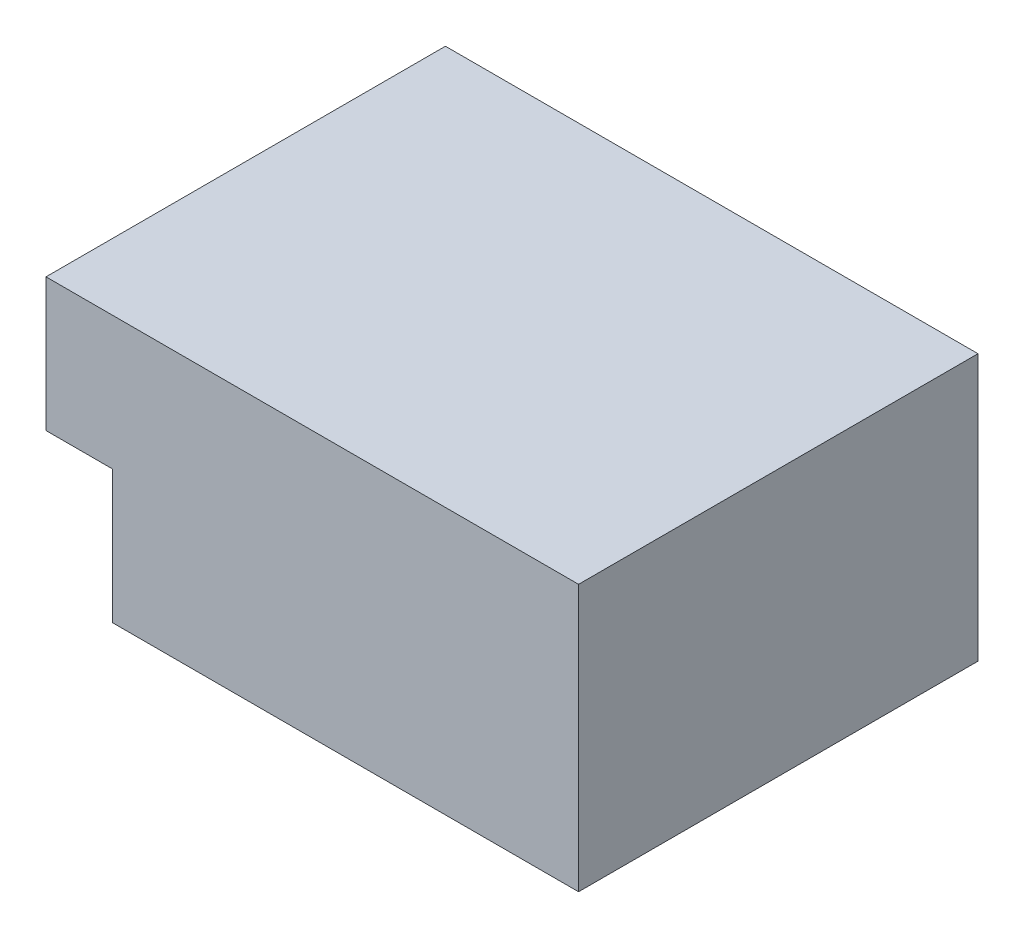
ISO-10303-21;
HEADER;
FILE_DESCRIPTION(('STEP AP214'),'2;1');
FILE_NAME('part.step','',(''),(''),'','','');
FILE_SCHEMA(('AUTOMOTIVE_DESIGN { 1 0 10303 214 1 1 1 1 }'));
ENDSEC;
DATA;
#1=APPLICATION_CONTEXT('core data for automotive mechanical design processes');
#2=APPLICATION_PROTOCOL_DEFINITION('international standard','automotive_design',2000,#1);
#3=PRODUCT_CONTEXT('',#1,'mechanical');
#4=PRODUCT('Part','Part','',(#3));
#5=PRODUCT_RELATED_PRODUCT_CATEGORY('part','',(#4));
#6=PRODUCT_DEFINITION_FORMATION('','',#4);
#7=PRODUCT_DEFINITION_CONTEXT('part definition',#1,'design');
#8=PRODUCT_DEFINITION('design','',#6,#7);
#9=PRODUCT_DEFINITION_SHAPE('','',#8);
#10=(LENGTH_UNIT() NAMED_UNIT(*) SI_UNIT(.MILLI.,.METRE.));
#11=(NAMED_UNIT(*) PLANE_ANGLE_UNIT() SI_UNIT($,.RADIAN.));
#12=(NAMED_UNIT(*) SI_UNIT($,.STERADIAN.) SOLID_ANGLE_UNIT());
#13=UNCERTAINTY_MEASURE_WITH_UNIT(LENGTH_MEASURE(1.E-05),#10,'distance_accuracy_value','');
#14=(GEOMETRIC_REPRESENTATION_CONTEXT(3) GLOBAL_UNCERTAINTY_ASSIGNED_CONTEXT((#13)) GLOBAL_UNIT_ASSIGNED_CONTEXT((#10,
#11,#12)) REPRESENTATION_CONTEXT('',''));
#15=CARTESIAN_POINT('',(0.,0.,0.));
#16=DIRECTION('',(0.,0.,1.));
#17=DIRECTION('',(1.,0.,0.));
#18=AXIS2_PLACEMENT_3D('',#15,#16,#17);
#19=CARTESIAN_POINT('',(0.,0.,0.));
#20=DIRECTION('',(0.,-1.,0.));
#21=DIRECTION('',(-1.,0.,0.));
#22=AXIS2_PLACEMENT_3D('',#19,#20,#21);
#23=PLANE('',#22);
#24=DIRECTION('',(0.,0.,-1.));
#25=VECTOR('',#24,1.);
#26=CARTESIAN_POINT('',(-1.95,0.,1.35));
#27=LINE('',#26,#25);
#28=CARTESIAN_POINT('',(-1.95,0.,1.35));
#29=VERTEX_POINT('',#28);
#30=CARTESIAN_POINT('',(-1.95,0.,1.05));
#31=VERTEX_POINT('',#30);
#32=EDGE_CURVE('E11',#29,#31,#27,.T.);
#33=ORIENTED_EDGE('',*,*,#32,.T.);
#34=DIRECTION('',(1.,0.,0.));
#35=VECTOR('',#34,1.);
#36=CARTESIAN_POINT('',(-1.95,0.,1.05));
#37=LINE('',#36,#35);
#38=CARTESIAN_POINT('',(-1.6,0.,1.05));
#39=VERTEX_POINT('',#38);
#40=EDGE_CURVE('E115',#31,#39,#37,.T.);
#41=ORIENTED_EDGE('',*,*,#40,.T.);
#42=DIRECTION('',(0.,0.,-1.));
#43=VECTOR('',#42,1.);
#44=CARTESIAN_POINT('',(-1.6,0.,1.35));
#45=LINE('',#44,#43);
#46=CARTESIAN_POINT('',(-1.6,0.,1.35));
#47=VERTEX_POINT('',#46);
#48=EDGE_CURVE('E109',#47,#39,#45,.T.);
#49=ORIENTED_EDGE('',*,*,#48,.F.);
#50=DIRECTION('',(-1.,0.,0.));
#51=VECTOR('',#50,1.);
#52=CARTESIAN_POINT('',(-1.6,0.,1.35));
#53=LINE('',#52,#51);
#54=EDGE_CURVE('E101',#47,#29,#53,.T.);
#55=ORIENTED_EDGE('',*,*,#54,.T.);
#56=EDGE_LOOP('',(#33,#41,#49,#55));
#57=FACE_BOUND('',#56,.T.);
#58=ADVANCED_FACE('F17',(#57),#23,.T.);
#59=CARTESIAN_POINT('',(-1.75,0.,1.35));
#60=DIRECTION('',(0.,0.,-1.));
#61=DIRECTION('',(-1.,0.,0.));
#62=AXIS2_PLACEMENT_3D('',#59,#60,#61);
#63=PLANE('',#62);
#64=DIRECTION('',(0.,1.,0.));
#65=VECTOR('',#64,1.);
#66=CARTESIAN_POINT('',(-2.,0.1,1.35));
#67=LINE('',#66,#65);
#68=CARTESIAN_POINT('',(-2.,0.1,1.35));
#69=VERTEX_POINT('',#68);
#70=CARTESIAN_POINT('',(-2.,0.2,1.35));
#71=VERTEX_POINT('',#70);
#72=EDGE_CURVE('E24',#69,#71,#67,.T.);
#73=ORIENTED_EDGE('',*,*,#72,.F.);
#74=DIRECTION('',(1.,0.,0.));
#75=VECTOR('',#74,1.);
#76=CARTESIAN_POINT('',(-2.,0.1,1.35));
#77=LINE('',#76,#75);
#78=CARTESIAN_POINT('',(-1.95,0.1,1.35));
#79=VERTEX_POINT('',#78);
#80=EDGE_CURVE('E85',#69,#79,#77,.T.);
#81=ORIENTED_EDGE('',*,*,#80,.T.);
#82=DIRECTION('',(0.,1.,0.));
#83=VECTOR('',#82,1.);
#84=CARTESIAN_POINT('',(-1.95,0.,1.35));
#85=LINE('',#84,#83);
#86=EDGE_CURVE('E103',#29,#79,#85,.T.);
#87=ORIENTED_EDGE('',*,*,#86,.F.);
#88=ORIENTED_EDGE('',*,*,#54,.F.);
#89=DIRECTION('',(0.,1.,0.));
#90=VECTOR('',#89,1.);
#91=CARTESIAN_POINT('',(-1.6,0.,1.35));
#92=LINE('',#91,#90);
#93=CARTESIAN_POINT('',(-1.6,0.2,1.35));
#94=VERTEX_POINT('',#93);
#95=EDGE_CURVE('E80',#47,#94,#92,.T.);
#96=ORIENTED_EDGE('',*,*,#95,.T.);
#97=DIRECTION('',(-1.,0.,0.));
#98=VECTOR('',#97,1.);
#99=CARTESIAN_POINT('',(-1.6,0.2,1.35));
#100=LINE('',#99,#98);
#101=EDGE_CURVE('E79',#94,#71,#100,.T.);
#102=ORIENTED_EDGE('',*,*,#101,.T.);
#103=EDGE_LOOP('',(#73,#81,#87,#88,#96,#102));
#104=FACE_BOUND('',#103,.T.);
#105=ADVANCED_FACE('F117',(#104),#63,.F.);
#106=CARTESIAN_POINT('',(0.,0.2,0.));
#107=DIRECTION('',(0.,-1.,0.));
#108=DIRECTION('',(-1.,0.,0.));
#109=AXIS2_PLACEMENT_3D('',#106,#107,#108);
#110=PLANE('',#109);
#111=DIRECTION('',(1.,0.,0.));
#112=VECTOR('',#111,1.);
#113=CARTESIAN_POINT('',(-2.,0.2,1.05));
#114=LINE('',#113,#112);
#115=CARTESIAN_POINT('',(-2.,0.2,1.05));
#116=VERTEX_POINT('',#115);
#117=CARTESIAN_POINT('',(-1.6,0.2,1.05));
#118=VERTEX_POINT('',#117);
#119=EDGE_CURVE('E113',#116,#118,#114,.T.);
#120=ORIENTED_EDGE('',*,*,#119,.F.);
#121=DIRECTION('',(0.,0.,-1.));
#122=VECTOR('',#121,1.);
#123=CARTESIAN_POINT('',(-2.,0.2,1.35));
#124=LINE('',#123,#122);
#125=EDGE_CURVE('E91',#71,#116,#124,.T.);
#126=ORIENTED_EDGE('',*,*,#125,.F.);
#127=ORIENTED_EDGE('',*,*,#101,.F.);
#128=DIRECTION('',(0.,0.,1.));
#129=VECTOR('',#128,1.);
#130=CARTESIAN_POINT('',(-1.6,0.2,1.05));
#131=LINE('',#130,#129);
#132=EDGE_CURVE('E98',#118,#94,#131,.T.);
#133=ORIENTED_EDGE('',*,*,#132,.F.);
#134=EDGE_LOOP('',(#120,#126,#127,#133));
#135=FACE_BOUND('',#134,.T.);
#136=ADVANCED_FACE('F122',(#135),#110,.F.);
#137=CARTESIAN_POINT('',(-1.6,0.,1.35));
#138=DIRECTION('',(1.,0.,0.));
#139=DIRECTION('',(0.,0.,-1.));
#140=AXIS2_PLACEMENT_3D('',#137,#138,#139);
#141=PLANE('',#140);
#142=DIRECTION('',(0.,1.,0.));
#143=VECTOR('',#142,1.);
#144=CARTESIAN_POINT('',(-1.6,0.,1.05));
#145=LINE('',#144,#143);
#146=EDGE_CURVE('E107',#39,#118,#145,.T.);
#147=ORIENTED_EDGE('',*,*,#146,.T.);
#148=ORIENTED_EDGE('',*,*,#132,.T.);
#149=ORIENTED_EDGE('',*,*,#95,.F.);
#150=ORIENTED_EDGE('',*,*,#48,.T.);
#151=EDGE_LOOP('',(#147,#148,#149,#150));
#152=FACE_BOUND('',#151,.T.);
#153=ADVANCED_FACE('F125',(#152),#141,.T.);
#154=CARTESIAN_POINT('',(-2.,0.,1.05));
#155=DIRECTION('',(0.,0.,1.));
#156=DIRECTION('',(1.,0.,0.));
#157=AXIS2_PLACEMENT_3D('',#154,#155,#156);
#158=PLANE('',#157);
#159=DIRECTION('',(0.,1.,0.));
#160=VECTOR('',#159,1.);
#161=CARTESIAN_POINT('',(-1.95,0.,1.05));
#162=LINE('',#161,#160);
#163=CARTESIAN_POINT('',(-1.95,0.1,1.05));
#164=VERTEX_POINT('',#163);
#165=EDGE_CURVE('E75',#31,#164,#162,.T.);
#166=ORIENTED_EDGE('',*,*,#165,.T.);
#167=DIRECTION('',(1.,0.,0.));
#168=VECTOR('',#167,1.);
#169=CARTESIAN_POINT('',(-2.,0.1,1.05));
#170=LINE('',#169,#168);
#171=CARTESIAN_POINT('',(-2.,0.1,1.05));
#172=VERTEX_POINT('',#171);
#173=EDGE_CURVE('E68',#172,#164,#170,.T.);
#174=ORIENTED_EDGE('',*,*,#173,.F.);
#175=DIRECTION('',(0.,1.,0.));
#176=VECTOR('',#175,1.);
#177=CARTESIAN_POINT('',(-2.,0.1,1.05));
#178=LINE('',#177,#176);
#179=EDGE_CURVE('E73',#172,#116,#178,.T.);
#180=ORIENTED_EDGE('',*,*,#179,.T.);
#181=ORIENTED_EDGE('',*,*,#119,.T.);
#182=ORIENTED_EDGE('',*,*,#146,.F.);
#183=ORIENTED_EDGE('',*,*,#40,.F.);
#184=EDGE_LOOP('',(#166,#174,#180,#181,#182,#183));
#185=FACE_BOUND('',#184,.T.);
#186=ADVANCED_FACE('F70',(#185),#158,.F.);
#187=CARTESIAN_POINT('',(-2.,0.,1.35));
#188=DIRECTION('',(1.,0.,0.));
#189=DIRECTION('',(0.,0.,-1.));
#190=AXIS2_PLACEMENT_3D('',#187,#188,#189);
#191=PLANE('',#190);
#192=ORIENTED_EDGE('',*,*,#72,.T.);
#193=ORIENTED_EDGE('',*,*,#125,.T.);
#194=ORIENTED_EDGE('',*,*,#179,.F.);
#195=DIRECTION('',(0.,0.,-1.));
#196=VECTOR('',#195,1.);
#197=CARTESIAN_POINT('',(-2.,0.1,1.35));
#198=LINE('',#197,#196);
#199=EDGE_CURVE('E83',#69,#172,#198,.T.);
#200=ORIENTED_EDGE('',*,*,#199,.F.);
#201=EDGE_LOOP('',(#192,#193,#194,#200));
#202=FACE_BOUND('',#201,.T.);
#203=ADVANCED_FACE('F90',(#202),#191,.F.);
#204=CARTESIAN_POINT('',(-2.,0.1,-1.92));
#205=DIRECTION('',(0.,-1.,0.));
#206=DIRECTION('',(1.,0.,0.));
#207=AXIS2_PLACEMENT_3D('',#204,#205,#206);
#208=PLANE('',#207);
#209=ORIENTED_EDGE('',*,*,#80,.F.);
#210=ORIENTED_EDGE('',*,*,#199,.T.);
#211=ORIENTED_EDGE('',*,*,#173,.T.);
#212=DIRECTION('',(0.,0.,1.));
#213=VECTOR('',#212,1.);
#214=CARTESIAN_POINT('',(-1.95,0.1,1.05));
#215=LINE('',#214,#213);
#216=EDGE_CURVE('E87',#164,#79,#215,.T.);
#217=ORIENTED_EDGE('',*,*,#216,.T.);
#218=EDGE_LOOP('',(#209,#210,#211,#217));
#219=FACE_BOUND('',#218,.T.);
#220=ADVANCED_FACE('F84',(#219),#208,.T.);
#221=CARTESIAN_POINT('',(-1.95,0.1,-1.92));
#222=DIRECTION('',(-1.,0.,0.));
#223=DIRECTION('',(0.,-1.,0.));
#224=AXIS2_PLACEMENT_3D('',#221,#222,#223);
#225=PLANE('',#224);
#226=ORIENTED_EDGE('',*,*,#165,.F.);
#227=ORIENTED_EDGE('',*,*,#32,.F.);
#228=ORIENTED_EDGE('',*,*,#86,.T.);
#229=ORIENTED_EDGE('',*,*,#216,.F.);
#230=EDGE_LOOP('',(#226,#227,#228,#229));
#231=FACE_BOUND('',#230,.T.);
#232=ADVANCED_FACE('F127',(#231),#225,.T.);
#233=CLOSED_SHELL('',(#58,#105,#136,#153,#186,#203,#220,#232));
#234=MANIFOLD_SOLID_BREP('B1',#233);
#235=ADVANCED_BREP_SHAPE_REPRESENTATION('',(#18,#234),#14);
#236=SHAPE_DEFINITION_REPRESENTATION(#9,#235);
ENDSEC;
END-ISO-10303-21;
